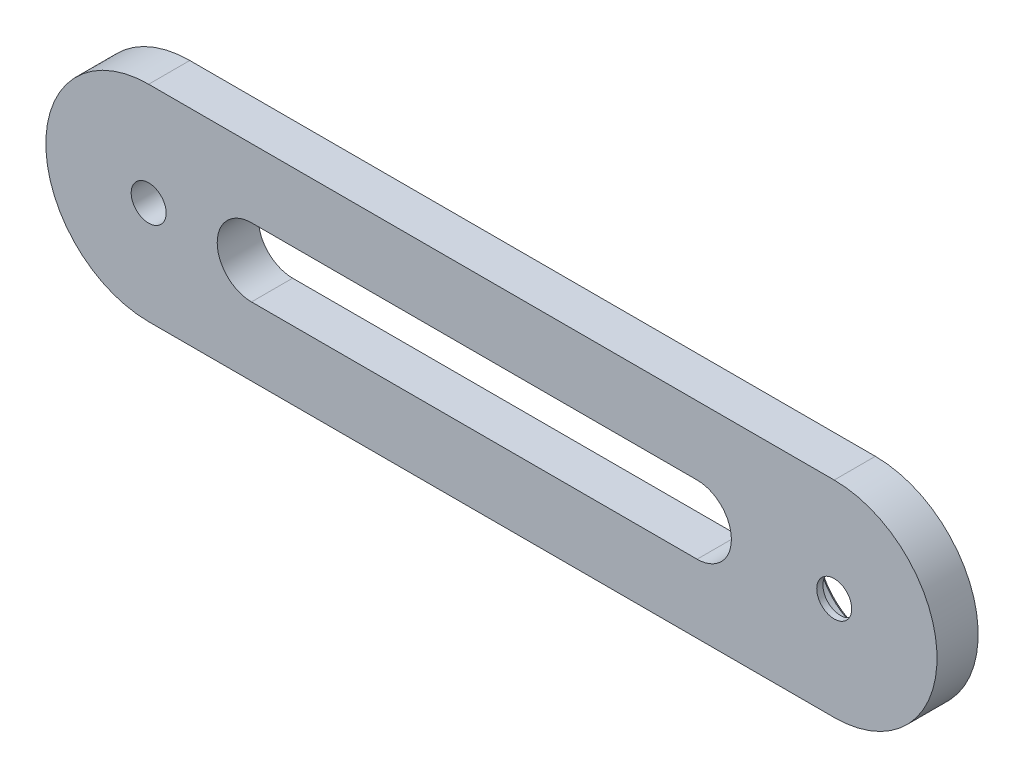
ISO-10303-21;
HEADER;
FILE_DESCRIPTION(('STEP AP214'),'2;1');
FILE_NAME('part.step','',(''),(''),'','','');
FILE_SCHEMA(('AUTOMOTIVE_DESIGN { 1 0 10303 214 1 1 1 1 }'));
ENDSEC;
DATA;
#1=APPLICATION_CONTEXT('core data for automotive mechanical design processes');
#2=APPLICATION_PROTOCOL_DEFINITION('international standard','automotive_design',2000,#1);
#3=PRODUCT_CONTEXT('',#1,'mechanical');
#4=PRODUCT('Part','Part','',(#3));
#5=PRODUCT_RELATED_PRODUCT_CATEGORY('part','',(#4));
#6=PRODUCT_DEFINITION_FORMATION('','',#4);
#7=PRODUCT_DEFINITION_CONTEXT('part definition',#1,'design');
#8=PRODUCT_DEFINITION('design','',#6,#7);
#9=PRODUCT_DEFINITION_SHAPE('','',#8);
#10=(LENGTH_UNIT() NAMED_UNIT(*) SI_UNIT(.MILLI.,.METRE.));
#11=(NAMED_UNIT(*) PLANE_ANGLE_UNIT() SI_UNIT($,.RADIAN.));
#12=(NAMED_UNIT(*) SI_UNIT($,.STERADIAN.) SOLID_ANGLE_UNIT());
#13=UNCERTAINTY_MEASURE_WITH_UNIT(LENGTH_MEASURE(1.E-05),#10,'distance_accuracy_value','');
#14=(GEOMETRIC_REPRESENTATION_CONTEXT(3) GLOBAL_UNCERTAINTY_ASSIGNED_CONTEXT((#13)) GLOBAL_UNIT_ASSIGNED_CONTEXT((#10,
#11,#12)) REPRESENTATION_CONTEXT('',''));
#15=CARTESIAN_POINT('',(0.,0.,0.));
#16=DIRECTION('',(0.,0.,1.));
#17=DIRECTION('',(1.,0.,0.));
#18=AXIS2_PLACEMENT_3D('',#15,#16,#17);
#19=CARTESIAN_POINT('',(-50.,0.,6.));
#20=DIRECTION('',(0.,0.,-1.));
#21=DIRECTION('',(-1.,0.,0.));
#22=AXIS2_PLACEMENT_3D('',#19,#20,#21);
#23=CYLINDRICAL_SURFACE('',#22,15.);
#24=CARTESIAN_POINT('',(-50.,0.,0.));
#25=DIRECTION('',(0.,0.,1.));
#26=DIRECTION('',(-1.,0.,0.));
#27=AXIS2_PLACEMENT_3D('',#24,#25,#26);
#28=CIRCLE('',#27,15.);
#29=CARTESIAN_POINT('',(-50.,15.,0.));
#30=VERTEX_POINT('',#29);
#31=CARTESIAN_POINT('',(-50.,-15.,0.));
#32=VERTEX_POINT('',#31);
#33=EDGE_CURVE('E181',#30,#32,#28,.T.);
#34=ORIENTED_EDGE('',*,*,#33,.T.);
#35=DIRECTION('',(0.,0.,-1.));
#36=VECTOR('',#35,1.);
#37=CARTESIAN_POINT('',(-50.,-15.,6.));
#38=LINE('',#37,#36);
#39=CARTESIAN_POINT('',(-50.,-15.,6.));
#40=VERTEX_POINT('',#39);
#41=EDGE_CURVE('E219',#40,#32,#38,.T.);
#42=ORIENTED_EDGE('',*,*,#41,.F.);
#43=CARTESIAN_POINT('',(-50.,0.,6.));
#44=DIRECTION('',(0.,0.,1.));
#45=DIRECTION('',(-1.,0.,0.));
#46=AXIS2_PLACEMENT_3D('',#43,#44,#45);
#47=CIRCLE('',#46,15.);
#48=CARTESIAN_POINT('',(-50.,15.,6.));
#49=VERTEX_POINT('',#48);
#50=EDGE_CURVE('E182',#49,#40,#47,.T.);
#51=ORIENTED_EDGE('',*,*,#50,.F.);
#52=DIRECTION('',(0.,0.,-1.));
#53=VECTOR('',#52,1.);
#54=CARTESIAN_POINT('',(-50.,15.,6.));
#55=LINE('',#54,#53);
#56=EDGE_CURVE('E196',#49,#30,#55,.T.);
#57=ORIENTED_EDGE('',*,*,#56,.T.);
#58=EDGE_LOOP('',(#34,#42,#51,#57));
#59=FACE_BOUND('',#58,.T.);
#60=ADVANCED_FACE('F46',(#59),#23,.T.);
#61=CARTESIAN_POINT('',(50.,-15.,6.));
#62=DIRECTION('',(0.,1.,0.));
#63=DIRECTION('',(0.,0.,1.));
#64=AXIS2_PLACEMENT_3D('',#61,#62,#63);
#65=PLANE('',#64);
#66=DIRECTION('',(1.,0.,0.));
#67=VECTOR('',#66,1.);
#68=CARTESIAN_POINT('',(50.,-15.,0.));
#69=LINE('',#68,#67);
#70=CARTESIAN_POINT('',(50.,-15.,0.));
#71=VERTEX_POINT('',#70);
#72=EDGE_CURVE('E200',#32,#71,#69,.T.);
#73=ORIENTED_EDGE('',*,*,#72,.T.);
#74=DIRECTION('',(0.,0.,-1.));
#75=VECTOR('',#74,1.);
#76=CARTESIAN_POINT('',(50.,-15.,6.));
#77=LINE('',#76,#75);
#78=CARTESIAN_POINT('',(50.,-15.,6.));
#79=VERTEX_POINT('',#78);
#80=EDGE_CURVE('E215',#79,#71,#77,.T.);
#81=ORIENTED_EDGE('',*,*,#80,.F.);
#82=DIRECTION('',(1.,0.,0.));
#83=VECTOR('',#82,1.);
#84=CARTESIAN_POINT('',(50.,-15.,6.));
#85=LINE('',#84,#83);
#86=EDGE_CURVE('E186',#40,#79,#85,.T.);
#87=ORIENTED_EDGE('',*,*,#86,.F.);
#88=ORIENTED_EDGE('',*,*,#41,.T.);
#89=EDGE_LOOP('',(#73,#81,#87,#88));
#90=FACE_BOUND('',#89,.T.);
#91=ADVANCED_FACE('F245',(#90),#65,.F.);
#92=CARTESIAN_POINT('',(50.,0.,6.));
#93=DIRECTION('',(0.,0.,-1.));
#94=DIRECTION('',(-1.,0.,0.));
#95=AXIS2_PLACEMENT_3D('',#92,#93,#94);
#96=CYLINDRICAL_SURFACE('',#95,15.);
#97=CARTESIAN_POINT('',(50.,0.,0.));
#98=DIRECTION('',(0.,0.,1.));
#99=DIRECTION('',(-1.,0.,0.));
#100=AXIS2_PLACEMENT_3D('',#97,#98,#99);
#101=CIRCLE('',#100,15.);
#102=CARTESIAN_POINT('',(50.,15.,0.));
#103=VERTEX_POINT('',#102);
#104=EDGE_CURVE('E203',#71,#103,#101,.T.);
#105=ORIENTED_EDGE('',*,*,#104,.T.);
#106=DIRECTION('',(0.,0.,-1.));
#107=VECTOR('',#106,1.);
#108=CARTESIAN_POINT('',(50.,15.,6.));
#109=LINE('',#108,#107);
#110=CARTESIAN_POINT('',(50.,15.,6.));
#111=VERTEX_POINT('',#110);
#112=EDGE_CURVE('E211',#111,#103,#109,.T.);
#113=ORIENTED_EDGE('',*,*,#112,.F.);
#114=CARTESIAN_POINT('',(50.,0.,6.));
#115=DIRECTION('',(0.,0.,1.));
#116=DIRECTION('',(-1.,0.,0.));
#117=AXIS2_PLACEMENT_3D('',#114,#115,#116);
#118=CIRCLE('',#117,15.);
#119=EDGE_CURVE('E190',#79,#111,#118,.T.);
#120=ORIENTED_EDGE('',*,*,#119,.F.);
#121=ORIENTED_EDGE('',*,*,#80,.T.);
#122=EDGE_LOOP('',(#105,#113,#120,#121));
#123=FACE_BOUND('',#122,.T.);
#124=ADVANCED_FACE('F250',(#123),#96,.T.);
#125=CARTESIAN_POINT('',(-50.,15.,6.));
#126=DIRECTION('',(0.,-1.,0.));
#127=DIRECTION('',(0.,0.,-1.));
#128=AXIS2_PLACEMENT_3D('',#125,#126,#127);
#129=PLANE('',#128);
#130=DIRECTION('',(-1.,0.,0.));
#131=VECTOR('',#130,1.);
#132=CARTESIAN_POINT('',(-50.,15.,0.));
#133=LINE('',#132,#131);
#134=EDGE_CURVE('E187',#103,#30,#133,.T.);
#135=ORIENTED_EDGE('',*,*,#134,.T.);
#136=ORIENTED_EDGE('',*,*,#56,.F.);
#137=DIRECTION('',(-1.,0.,0.));
#138=VECTOR('',#137,1.);
#139=CARTESIAN_POINT('',(-50.,15.,6.));
#140=LINE('',#139,#138);
#141=EDGE_CURVE('E193',#111,#49,#140,.T.);
#142=ORIENTED_EDGE('',*,*,#141,.F.);
#143=ORIENTED_EDGE('',*,*,#112,.T.);
#144=EDGE_LOOP('',(#135,#136,#142,#143));
#145=FACE_BOUND('',#144,.T.);
#146=ADVANCED_FACE('F256',(#145),#129,.F.);
#147=CARTESIAN_POINT('',(-50.,0.,6.));
#148=DIRECTION('',(0.,0.,-1.));
#149=DIRECTION('',(-1.,0.,0.));
#150=AXIS2_PLACEMENT_3D('',#147,#148,#149);
#151=PLANE('',#150);
#152=DIRECTION('',(1.,0.,0.));
#153=VECTOR('',#152,1.);
#154=CARTESIAN_POINT('',(30.,5.,6.));
#155=LINE('',#154,#153);
#156=CARTESIAN_POINT('',(-35.,5.,6.));
#157=VERTEX_POINT('',#156);
#158=CARTESIAN_POINT('',(30.,5.,6.));
#159=VERTEX_POINT('',#158);
#160=EDGE_CURVE('E122',#157,#159,#155,.T.);
#161=ORIENTED_EDGE('',*,*,#160,.T.);
#162=CARTESIAN_POINT('',(30.,0.,6.));
#163=DIRECTION('',(0.,0.,-1.));
#164=DIRECTION('',(-1.,0.,0.));
#165=AXIS2_PLACEMENT_3D('',#162,#163,#164);
#166=CIRCLE('',#165,5.00000000000001);
#167=CARTESIAN_POINT('',(30.,-5.00000000000002,6.));
#168=VERTEX_POINT('',#167);
#169=EDGE_CURVE('E115',#159,#168,#166,.T.);
#170=ORIENTED_EDGE('',*,*,#169,.T.);
#171=DIRECTION('',(-1.,0.,0.));
#172=VECTOR('',#171,1.);
#173=CARTESIAN_POINT('',(30.,-5.00000000000002,6.));
#174=LINE('',#173,#172);
#175=CARTESIAN_POINT('',(-35.,-5.,6.));
#176=VERTEX_POINT('',#175);
#177=EDGE_CURVE('E125',#168,#176,#174,.T.);
#178=ORIENTED_EDGE('',*,*,#177,.T.);
#179=CARTESIAN_POINT('',(-35.,0.,6.));
#180=DIRECTION('',(0.,0.,-1.));
#181=DIRECTION('',(-1.,0.,0.));
#182=AXIS2_PLACEMENT_3D('',#179,#180,#181);
#183=CIRCLE('',#182,5.);
#184=EDGE_CURVE('E63',#176,#157,#183,.T.);
#185=ORIENTED_EDGE('',*,*,#184,.T.);
#186=EDGE_LOOP('',(#161,#170,#178,#185));
#187=FACE_BOUND('',#186,.T.);
#188=CARTESIAN_POINT('',(-50.,0.,6.));
#189=DIRECTION('',(0.,0.,-1.));
#190=DIRECTION('',(-1.,0.,0.));
#191=AXIS2_PLACEMENT_3D('',#188,#189,#190);
#192=CIRCLE('',#191,2.55);
#193=CARTESIAN_POINT('',(-52.55,0.,6.));
#194=VERTEX_POINT('',#193);
#195=EDGE_CURVE('E162',#194,#194,#192,.T.);
#196=ORIENTED_EDGE('',*,*,#195,.T.);
#197=EDGE_LOOP('',(#196));
#198=FACE_BOUND('',#197,.T.);
#199=CARTESIAN_POINT('',(50.,0.,6.));
#200=DIRECTION('',(0.,0.,-1.));
#201=DIRECTION('',(-1.,0.,0.));
#202=AXIS2_PLACEMENT_3D('',#199,#200,#201);
#203=CIRCLE('',#202,2.55);
#204=CARTESIAN_POINT('',(47.45,0.,6.));
#205=VERTEX_POINT('',#204);
#206=EDGE_CURVE('E170',#205,#205,#203,.T.);
#207=ORIENTED_EDGE('',*,*,#206,.T.);
#208=EDGE_LOOP('',(#207));
#209=FACE_BOUND('',#208,.T.);
#210=ORIENTED_EDGE('',*,*,#50,.T.);
#211=ORIENTED_EDGE('',*,*,#86,.T.);
#212=ORIENTED_EDGE('',*,*,#119,.T.);
#213=ORIENTED_EDGE('',*,*,#141,.T.);
#214=EDGE_LOOP('',(#210,#211,#212,#213));
#215=FACE_BOUND('',#214,.T.);
#216=ADVANCED_FACE('F130',(#187,#198,#209,#215),#151,.F.);
#217=CARTESIAN_POINT('',(-50.,0.,0.));
#218=DIRECTION('',(0.,0.,-1.));
#219=DIRECTION('',(-1.,0.,0.));
#220=AXIS2_PLACEMENT_3D('',#217,#218,#219);
#221=PLANE('',#220);
#222=CARTESIAN_POINT('',(30.,0.,0.));
#223=DIRECTION('',(0.,0.,-1.));
#224=DIRECTION('',(-1.,0.,0.));
#225=AXIS2_PLACEMENT_3D('',#222,#223,#224);
#226=CIRCLE('',#225,5.00000000000001);
#227=CARTESIAN_POINT('',(30.,5.,0.));
#228=VERTEX_POINT('',#227);
#229=CARTESIAN_POINT('',(30.,-5.00000000000002,0.));
#230=VERTEX_POINT('',#229);
#231=EDGE_CURVE('E71',#228,#230,#226,.T.);
#232=ORIENTED_EDGE('',*,*,#231,.F.);
#233=DIRECTION('',(1.,0.,0.));
#234=VECTOR('',#233,1.);
#235=CARTESIAN_POINT('',(30.,5.,0.));
#236=LINE('',#235,#234);
#237=CARTESIAN_POINT('',(-35.,5.,0.));
#238=VERTEX_POINT('',#237);
#239=EDGE_CURVE('E134',#238,#228,#236,.T.);
#240=ORIENTED_EDGE('',*,*,#239,.F.);
#241=CARTESIAN_POINT('',(-35.,0.,0.));
#242=DIRECTION('',(0.,0.,-1.));
#243=DIRECTION('',(-1.,0.,0.));
#244=AXIS2_PLACEMENT_3D('',#241,#242,#243);
#245=CIRCLE('',#244,5.);
#246=CARTESIAN_POINT('',(-35.,-5.,0.));
#247=VERTEX_POINT('',#246);
#248=EDGE_CURVE('E138',#247,#238,#245,.T.);
#249=ORIENTED_EDGE('',*,*,#248,.F.);
#250=DIRECTION('',(-1.,0.,0.));
#251=VECTOR('',#250,1.);
#252=CARTESIAN_POINT('',(30.,-5.00000000000002,0.));
#253=LINE('',#252,#251);
#254=EDGE_CURVE('E147',#230,#247,#253,.T.);
#255=ORIENTED_EDGE('',*,*,#254,.F.);
#256=EDGE_LOOP('',(#232,#240,#249,#255));
#257=FACE_BOUND('',#256,.T.);
#258=CARTESIAN_POINT('',(50.,0.,0.));
#259=DIRECTION('',(0.,0.,-1.));
#260=DIRECTION('',(-1.,0.,0.));
#261=AXIS2_PLACEMENT_3D('',#258,#259,#260);
#262=CIRCLE('',#261,8.47499999999998);
#263=CARTESIAN_POINT('',(41.525,0.,0.));
#264=VERTEX_POINT('',#263);
#265=EDGE_CURVE('E11',#264,#264,#262,.F.);
#266=ORIENTED_EDGE('',*,*,#265,.T.);
#267=EDGE_LOOP('',(#266));
#268=FACE_BOUND('',#267,.T.);
#269=CARTESIAN_POINT('',(-50.,0.,0.));
#270=DIRECTION('',(0.,0.,-1.));
#271=DIRECTION('',(-1.,0.,0.));
#272=AXIS2_PLACEMENT_3D('',#269,#270,#271);
#273=CIRCLE('',#272,2.55);
#274=CARTESIAN_POINT('',(-52.55,0.,0.));
#275=VERTEX_POINT('',#274);
#276=EDGE_CURVE('E156',#275,#275,#273,.T.);
#277=ORIENTED_EDGE('',*,*,#276,.F.);
#278=EDGE_LOOP('',(#277));
#279=FACE_BOUND('',#278,.T.);
#280=ORIENTED_EDGE('',*,*,#33,.F.);
#281=ORIENTED_EDGE('',*,*,#134,.F.);
#282=ORIENTED_EDGE('',*,*,#104,.F.);
#283=ORIENTED_EDGE('',*,*,#72,.F.);
#284=EDGE_LOOP('',(#280,#281,#282,#283));
#285=FACE_BOUND('',#284,.T.);
#286=ADVANCED_FACE('F261',(#257,#268,#279,#285),#221,.T.);
#287=CARTESIAN_POINT('',(50.,0.,5.1));
#288=DIRECTION('',(0.,0.,-1.));
#289=DIRECTION('',(-1.,0.,0.));
#290=AXIS2_PLACEMENT_3D('',#287,#288,#289);
#291=CYLINDRICAL_SURFACE('',#290,7.975);
#292=CARTESIAN_POINT('',(50.,0.,0.499999999999997));
#293=DIRECTION('',(0.,0.,-1.));
#294=DIRECTION('',(-1.,0.,0.));
#295=AXIS2_PLACEMENT_3D('',#292,#293,#294);
#296=CIRCLE('',#295,7.975);
#297=CARTESIAN_POINT('',(42.025,0.,0.499999999999997));
#298=VERTEX_POINT('',#297);
#299=EDGE_CURVE('E56',#298,#298,#296,.T.);
#300=ORIENTED_EDGE('',*,*,#299,.T.);
#301=EDGE_LOOP('',(#300));
#302=FACE_BOUND('',#301,.T.);
#303=CARTESIAN_POINT('',(50.,0.,5.1));
#304=DIRECTION('',(0.,0.,-1.));
#305=DIRECTION('',(-1.,0.,0.));
#306=AXIS2_PLACEMENT_3D('',#303,#304,#305);
#307=CIRCLE('',#306,7.975);
#308=CARTESIAN_POINT('',(42.025,0.,5.1));
#309=VERTEX_POINT('',#308);
#310=EDGE_CURVE('E174',#309,#309,#307,.T.);
#311=ORIENTED_EDGE('',*,*,#310,.F.);
#312=EDGE_LOOP('',(#311));
#313=FACE_BOUND('',#312,.T.);
#314=ADVANCED_FACE('F226',(#302,#313),#291,.F.);
#315=CARTESIAN_POINT('',(50.,0.,5.1));
#316=DIRECTION('',(0.,0.,-1.));
#317=DIRECTION('',(-1.,0.,0.));
#318=AXIS2_PLACEMENT_3D('',#315,#316,#317);
#319=PLANE('',#318);
#320=CARTESIAN_POINT('',(50.,0.,5.1));
#321=DIRECTION('',(0.,0.,-1.));
#322=DIRECTION('',(-1.,0.,0.));
#323=AXIS2_PLACEMENT_3D('',#320,#321,#322);
#324=CIRCLE('',#323,2.55);
#325=CARTESIAN_POINT('',(47.45,0.,5.1));
#326=VERTEX_POINT('',#325);
#327=EDGE_CURVE('E166',#326,#326,#324,.T.);
#328=ORIENTED_EDGE('',*,*,#327,.F.);
#329=EDGE_LOOP('',(#328));
#330=FACE_BOUND('',#329,.T.);
#331=ORIENTED_EDGE('',*,*,#310,.T.);
#332=EDGE_LOOP('',(#331));
#333=FACE_BOUND('',#332,.T.);
#334=ADVANCED_FACE('F267',(#330,#333),#319,.T.);
#335=CARTESIAN_POINT('',(50.,0.,6.));
#336=DIRECTION('',(0.,0.,-1.));
#337=DIRECTION('',(-1.,0.,0.));
#338=AXIS2_PLACEMENT_3D('',#335,#336,#337);
#339=CYLINDRICAL_SURFACE('',#338,2.55);
#340=ORIENTED_EDGE('',*,*,#206,.F.);
#341=EDGE_LOOP('',(#340));
#342=FACE_BOUND('',#341,.T.);
#343=ORIENTED_EDGE('',*,*,#327,.T.);
#344=EDGE_LOOP('',(#343));
#345=FACE_BOUND('',#344,.T.);
#346=ADVANCED_FACE('F240',(#342,#345),#339,.F.);
#347=CARTESIAN_POINT('',(-50.,0.,6.));
#348=DIRECTION('',(0.,0.,-1.));
#349=DIRECTION('',(-1.,0.,0.));
#350=AXIS2_PLACEMENT_3D('',#347,#348,#349);
#351=CYLINDRICAL_SURFACE('',#350,2.55);
#352=ORIENTED_EDGE('',*,*,#195,.F.);
#353=EDGE_LOOP('',(#352));
#354=FACE_BOUND('',#353,.T.);
#355=ORIENTED_EDGE('',*,*,#276,.T.);
#356=EDGE_LOOP('',(#355));
#357=FACE_BOUND('',#356,.T.);
#358=ADVANCED_FACE('F230',(#354,#357),#351,.F.);
#359=CARTESIAN_POINT('',(50.,0.,0.499999999999997));
#360=DIRECTION('',(0.,0.,-1.));
#361=DIRECTION('',(-1.,0.,0.));
#362=AXIS2_PLACEMENT_3D('',#359,#360,#361);
#363=CONICAL_SURFACE('',#362,7.975,0.785398163397434);
#364=ORIENTED_EDGE('',*,*,#265,.F.);
#365=EDGE_LOOP('',(#364));
#366=FACE_BOUND('',#365,.T.);
#367=ORIENTED_EDGE('',*,*,#299,.F.);
#368=EDGE_LOOP('',(#367));
#369=FACE_BOUND('',#368,.T.);
#370=ADVANCED_FACE('F49',(#366,#369),#363,.F.);
#371=CARTESIAN_POINT('',(30.,0.,6.));
#372=DIRECTION('',(0.,0.,-1.));
#373=DIRECTION('',(-1.,0.,0.));
#374=AXIS2_PLACEMENT_3D('',#371,#372,#373);
#375=CYLINDRICAL_SURFACE('',#374,5.00000000000001);
#376=ORIENTED_EDGE('',*,*,#231,.T.);
#377=DIRECTION('',(0.,0.,-1.));
#378=VECTOR('',#377,1.);
#379=CARTESIAN_POINT('',(30.,-5.00000000000002,6.));
#380=LINE('',#379,#378);
#381=EDGE_CURVE('E111',#168,#230,#380,.T.);
#382=ORIENTED_EDGE('',*,*,#381,.F.);
#383=ORIENTED_EDGE('',*,*,#169,.F.);
#384=DIRECTION('',(0.,0.,-1.));
#385=VECTOR('',#384,1.);
#386=CARTESIAN_POINT('',(30.,5.,6.));
#387=LINE('',#386,#385);
#388=EDGE_CURVE('E153',#159,#228,#387,.T.);
#389=ORIENTED_EDGE('',*,*,#388,.T.);
#390=EDGE_LOOP('',(#376,#382,#383,#389));
#391=FACE_BOUND('',#390,.T.);
#392=ADVANCED_FACE('F113',(#391),#375,.F.);
#393=CARTESIAN_POINT('',(30.,5.,6.));
#394=DIRECTION('',(0.,1.,0.));
#395=DIRECTION('',(-1.,0.,0.));
#396=AXIS2_PLACEMENT_3D('',#393,#394,#395);
#397=PLANE('',#396);
#398=ORIENTED_EDGE('',*,*,#239,.T.);
#399=ORIENTED_EDGE('',*,*,#388,.F.);
#400=ORIENTED_EDGE('',*,*,#160,.F.);
#401=DIRECTION('',(0.,0.,-1.));
#402=VECTOR('',#401,1.);
#403=CARTESIAN_POINT('',(-35.,5.,6.));
#404=LINE('',#403,#402);
#405=EDGE_CURVE('E157',#157,#238,#404,.T.);
#406=ORIENTED_EDGE('',*,*,#405,.T.);
#407=EDGE_LOOP('',(#398,#399,#400,#406));
#408=FACE_BOUND('',#407,.T.);
#409=ADVANCED_FACE('F237',(#408),#397,.F.);
#410=CARTESIAN_POINT('',(-35.,0.,6.));
#411=DIRECTION('',(0.,0.,-1.));
#412=DIRECTION('',(-1.,0.,0.));
#413=AXIS2_PLACEMENT_3D('',#410,#411,#412);
#414=CYLINDRICAL_SURFACE('',#413,5.);
#415=ORIENTED_EDGE('',*,*,#248,.T.);
#416=ORIENTED_EDGE('',*,*,#405,.F.);
#417=ORIENTED_EDGE('',*,*,#184,.F.);
#418=DIRECTION('',(0.,0.,-1.));
#419=VECTOR('',#418,1.);
#420=CARTESIAN_POINT('',(-35.,-5.,6.));
#421=LINE('',#420,#419);
#422=EDGE_CURVE('E121',#176,#247,#421,.T.);
#423=ORIENTED_EDGE('',*,*,#422,.T.);
#424=EDGE_LOOP('',(#415,#416,#417,#423));
#425=FACE_BOUND('',#424,.T.);
#426=ADVANCED_FACE('F276',(#425),#414,.F.);
#427=CARTESIAN_POINT('',(30.,-5.00000000000002,6.));
#428=DIRECTION('',(0.,-1.,0.));
#429=DIRECTION('',(1.,0.,0.));
#430=AXIS2_PLACEMENT_3D('',#427,#428,#429);
#431=PLANE('',#430);
#432=ORIENTED_EDGE('',*,*,#254,.T.);
#433=ORIENTED_EDGE('',*,*,#422,.F.);
#434=ORIENTED_EDGE('',*,*,#177,.F.);
#435=ORIENTED_EDGE('',*,*,#381,.T.);
#436=EDGE_LOOP('',(#432,#433,#434,#435));
#437=FACE_BOUND('',#436,.T.);
#438=ADVANCED_FACE('F126',(#437),#431,.F.);
#439=CLOSED_SHELL('',(#60,#91,#124,#146,#216,#286,#314,#334,#346,#358,#370,#392,#409,#426,#438));
#440=MANIFOLD_SOLID_BREP('B2',#439);
#441=ADVANCED_BREP_SHAPE_REPRESENTATION('',(#18,#440),#14);
#442=SHAPE_DEFINITION_REPRESENTATION(#9,#441);
ENDSEC;
END-ISO-10303-21;
